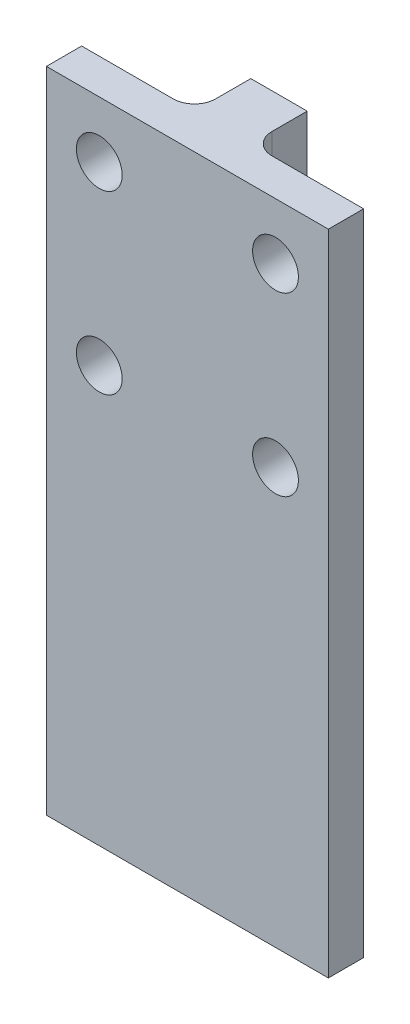
ISO-10303-21;
HEADER;
FILE_DESCRIPTION(('STEP AP214'),'2;1');
FILE_NAME('part.step','',(''),(''),'','','');
FILE_SCHEMA(('AUTOMOTIVE_DESIGN { 1 0 10303 214 1 1 1 1 }'));
ENDSEC;
DATA;
#1=APPLICATION_CONTEXT('core data for automotive mechanical design processes');
#2=APPLICATION_PROTOCOL_DEFINITION('international standard','automotive_design',2000,#1);
#3=PRODUCT_CONTEXT('',#1,'mechanical');
#4=PRODUCT('Part','Part','',(#3));
#5=PRODUCT_RELATED_PRODUCT_CATEGORY('part','',(#4));
#6=PRODUCT_DEFINITION_FORMATION('','',#4);
#7=PRODUCT_DEFINITION_CONTEXT('part definition',#1,'design');
#8=PRODUCT_DEFINITION('design','',#6,#7);
#9=PRODUCT_DEFINITION_SHAPE('','',#8);
#10=(LENGTH_UNIT() NAMED_UNIT(*) SI_UNIT(.MILLI.,.METRE.));
#11=(NAMED_UNIT(*) PLANE_ANGLE_UNIT() SI_UNIT($,.RADIAN.));
#12=(NAMED_UNIT(*) SI_UNIT($,.STERADIAN.) SOLID_ANGLE_UNIT());
#13=UNCERTAINTY_MEASURE_WITH_UNIT(LENGTH_MEASURE(1.E-05),#10,'distance_accuracy_value','');
#14=(GEOMETRIC_REPRESENTATION_CONTEXT(3) GLOBAL_UNCERTAINTY_ASSIGNED_CONTEXT((#13)) GLOBAL_UNIT_ASSIGNED_CONTEXT((#10,
#11,#12)) REPRESENTATION_CONTEXT('',''));
#15=CARTESIAN_POINT('',(0.,0.,0.));
#16=DIRECTION('',(0.,0.,1.));
#17=DIRECTION('',(1.,0.,0.));
#18=AXIS2_PLACEMENT_3D('',#15,#16,#17);
#19=CARTESIAN_POINT('',(-4.,-92.,-5.));
#20=DIRECTION('',(1.,0.,0.));
#21=DIRECTION('',(0.,0.,-1.));
#22=AXIS2_PLACEMENT_3D('',#19,#20,#21);
#23=PLANE('',#22);
#24=DIRECTION('',(0.,0.,-1.));
#25=VECTOR('',#24,1.);
#26=CARTESIAN_POINT('',(-4.,-92.,-5.));
#27=LINE('',#26,#25);
#28=CARTESIAN_POINT('',(-4.,-92.,-8.));
#29=VERTEX_POINT('',#28);
#30=CARTESIAN_POINT('',(-4.,-92.,-13.));
#31=VERTEX_POINT('',#30);
#32=EDGE_CURVE('E111',#29,#31,#27,.T.);
#33=ORIENTED_EDGE('',*,*,#32,.F.);
#34=DIRECTION('',(0.,1.,0.));
#35=VECTOR('',#34,1.);
#36=CARTESIAN_POINT('',(-4.,-92.,-8.));
#37=LINE('',#36,#35);
#38=CARTESIAN_POINT('',(-4.,0.,-8.));
#39=VERTEX_POINT('',#38);
#40=EDGE_CURVE('E145',#29,#39,#37,.T.);
#41=ORIENTED_EDGE('',*,*,#40,.T.);
#42=DIRECTION('',(0.,0.,-1.));
#43=VECTOR('',#42,1.);
#44=CARTESIAN_POINT('',(-4.,0.,-5.));
#45=LINE('',#44,#43);
#46=CARTESIAN_POINT('',(-4.,0.,-13.));
#47=VERTEX_POINT('',#46);
#48=EDGE_CURVE('E133',#39,#47,#45,.T.);
#49=ORIENTED_EDGE('',*,*,#48,.T.);
#50=DIRECTION('',(0.,1.,0.));
#51=VECTOR('',#50,1.);
#52=CARTESIAN_POINT('',(-4.,-92.,-13.));
#53=LINE('',#52,#51);
#54=EDGE_CURVE('E128',#31,#47,#53,.T.);
#55=ORIENTED_EDGE('',*,*,#54,.F.);
#56=EDGE_LOOP('',(#33,#41,#49,#55));
#57=FACE_BOUND('',#56,.T.);
#58=ADVANCED_FACE('F34',(#57),#23,.F.);
#59=CARTESIAN_POINT('',(-4.,-92.,-13.));
#60=DIRECTION('',(0.,0.,1.));
#61=DIRECTION('',(1.,0.,0.));
#62=AXIS2_PLACEMENT_3D('',#59,#60,#61);
#63=PLANE('',#62);
#64=DIRECTION('',(1.,0.,0.));
#65=VECTOR('',#64,1.);
#66=CARTESIAN_POINT('',(-4.,0.,-13.));
#67=LINE('',#66,#65);
#68=CARTESIAN_POINT('',(4.,0.,-13.));
#69=VERTEX_POINT('',#68);
#70=EDGE_CURVE('E192',#47,#69,#67,.T.);
#71=ORIENTED_EDGE('',*,*,#70,.T.);
#72=DIRECTION('',(0.,1.,0.));
#73=VECTOR('',#72,1.);
#74=CARTESIAN_POINT('',(4.,-92.,-13.));
#75=LINE('',#74,#73);
#76=CARTESIAN_POINT('',(4.,-92.,-13.));
#77=VERTEX_POINT('',#76);
#78=EDGE_CURVE('E130',#77,#69,#75,.T.);
#79=ORIENTED_EDGE('',*,*,#78,.F.);
#80=DIRECTION('',(1.,0.,0.));
#81=VECTOR('',#80,1.);
#82=CARTESIAN_POINT('',(-4.,-92.,-13.));
#83=LINE('',#82,#81);
#84=EDGE_CURVE('E115',#31,#77,#83,.T.);
#85=ORIENTED_EDGE('',*,*,#84,.F.);
#86=ORIENTED_EDGE('',*,*,#54,.T.);
#87=EDGE_LOOP('',(#71,#79,#85,#86));
#88=FACE_BOUND('',#87,.T.);
#89=ADVANCED_FACE('F127',(#88),#63,.F.);
#90=CARTESIAN_POINT('',(4.,-92.,-5.));
#91=DIRECTION('',(1.,0.,0.));
#92=DIRECTION('',(0.,0.,-1.));
#93=AXIS2_PLACEMENT_3D('',#90,#91,#92);
#94=PLANE('',#93);
#95=DIRECTION('',(0.,0.,-1.));
#96=VECTOR('',#95,1.);
#97=CARTESIAN_POINT('',(4.,0.,-5.));
#98=LINE('',#97,#96);
#99=CARTESIAN_POINT('',(4.,0.,-8.));
#100=VERTEX_POINT('',#99);
#101=EDGE_CURVE('E194',#100,#69,#98,.T.);
#102=ORIENTED_EDGE('',*,*,#101,.F.);
#103=DIRECTION('',(0.,1.,0.));
#104=VECTOR('',#103,1.);
#105=CARTESIAN_POINT('',(4.,-92.,-8.));
#106=LINE('',#105,#104);
#107=CARTESIAN_POINT('',(4.,-92.,-8.));
#108=VERTEX_POINT('',#107);
#109=EDGE_CURVE('E138',#100,#108,#106,.F.);
#110=ORIENTED_EDGE('',*,*,#109,.T.);
#111=DIRECTION('',(0.,0.,-1.));
#112=VECTOR('',#111,1.);
#113=CARTESIAN_POINT('',(4.,-92.,-5.));
#114=LINE('',#113,#112);
#115=EDGE_CURVE('E131',#108,#77,#114,.T.);
#116=ORIENTED_EDGE('',*,*,#115,.T.);
#117=ORIENTED_EDGE('',*,*,#78,.T.);
#118=EDGE_LOOP('',(#102,#110,#116,#117));
#119=FACE_BOUND('',#118,.T.);
#120=ADVANCED_FACE('F237',(#119),#94,.T.);
#121=CARTESIAN_POINT('',(4.,-92.,-5.));
#122=DIRECTION('',(0.,0.,1.));
#123=DIRECTION('',(1.,0.,0.));
#124=AXIS2_PLACEMENT_3D('',#121,#122,#123);
#125=PLANE('',#124);
#126=CARTESIAN_POINT('',(12.5,-33.,-5.));
#127=DIRECTION('',(0.,0.,1.));
#128=DIRECTION('',(1.,0.,0.));
#129=AXIS2_PLACEMENT_3D('',#126,#127,#128);
#130=CIRCLE('',#129,3.25);
#131=CARTESIAN_POINT('',(15.75,-33.,-5.));
#132=VERTEX_POINT('',#131);
#133=EDGE_CURVE('E173',#132,#132,#130,.T.);
#134=ORIENTED_EDGE('',*,*,#133,.T.);
#135=EDGE_LOOP('',(#134));
#136=FACE_BOUND('',#135,.T.);
#137=CARTESIAN_POINT('',(12.5,-8.,-5.));
#138=DIRECTION('',(0.,0.,1.));
#139=DIRECTION('',(1.,0.,0.));
#140=AXIS2_PLACEMENT_3D('',#137,#138,#139);
#141=CIRCLE('',#140,3.25);
#142=CARTESIAN_POINT('',(15.75,-8.,-5.));
#143=VERTEX_POINT('',#142);
#144=EDGE_CURVE('E158',#143,#143,#141,.T.);
#145=ORIENTED_EDGE('',*,*,#144,.T.);
#146=EDGE_LOOP('',(#145));
#147=FACE_BOUND('',#146,.T.);
#148=DIRECTION('',(1.,0.,0.));
#149=VECTOR('',#148,1.);
#150=CARTESIAN_POINT('',(4.,-92.,-5.));
#151=LINE('',#150,#149);
#152=CARTESIAN_POINT('',(7.,-92.,-5.));
#153=VERTEX_POINT('',#152);
#154=CARTESIAN_POINT('',(20.,-92.,-5.));
#155=VERTEX_POINT('',#154);
#156=EDGE_CURVE('E177',#153,#155,#151,.T.);
#157=ORIENTED_EDGE('',*,*,#156,.F.);
#158=DIRECTION('',(0.,1.,0.));
#159=VECTOR('',#158,1.);
#160=CARTESIAN_POINT('',(7.,-92.,-5.));
#161=LINE('',#160,#159);
#162=CARTESIAN_POINT('',(7.,0.,-5.));
#163=VERTEX_POINT('',#162);
#164=EDGE_CURVE('E135',#153,#163,#161,.T.);
#165=ORIENTED_EDGE('',*,*,#164,.T.);
#166=DIRECTION('',(1.,0.,0.));
#167=VECTOR('',#166,1.);
#168=CARTESIAN_POINT('',(4.,0.,-5.));
#169=LINE('',#168,#167);
#170=CARTESIAN_POINT('',(20.,0.,-5.));
#171=VERTEX_POINT('',#170);
#172=EDGE_CURVE('E196',#163,#171,#169,.T.);
#173=ORIENTED_EDGE('',*,*,#172,.T.);
#174=DIRECTION('',(0.,1.,0.));
#175=VECTOR('',#174,1.);
#176=CARTESIAN_POINT('',(20.,-92.,-5.));
#177=LINE('',#176,#175);
#178=EDGE_CURVE('E140',#155,#171,#177,.T.);
#179=ORIENTED_EDGE('',*,*,#178,.F.);
#180=EDGE_LOOP('',(#157,#165,#173,#179));
#181=FACE_BOUND('',#180,.T.);
#182=ADVANCED_FACE('F231',(#136,#147,#181),#125,.F.);
#183=CARTESIAN_POINT('',(20.,-92.,0.));
#184=DIRECTION('',(1.,0.,0.));
#185=DIRECTION('',(0.,0.,-1.));
#186=AXIS2_PLACEMENT_3D('',#183,#184,#185);
#187=PLANE('',#186);
#188=DIRECTION('',(0.,0.,-1.));
#189=VECTOR('',#188,1.);
#190=CARTESIAN_POINT('',(20.,0.,0.));
#191=LINE('',#190,#189);
#192=CARTESIAN_POINT('',(20.,0.,0.));
#193=VERTEX_POINT('',#192);
#194=EDGE_CURVE('E198',#193,#171,#191,.T.);
#195=ORIENTED_EDGE('',*,*,#194,.F.);
#196=DIRECTION('',(0.,1.,0.));
#197=VECTOR('',#196,1.);
#198=CARTESIAN_POINT('',(20.,-92.,0.));
#199=LINE('',#198,#197);
#200=CARTESIAN_POINT('',(20.,-92.,0.));
#201=VERTEX_POINT('',#200);
#202=EDGE_CURVE('E212',#201,#193,#199,.T.);
#203=ORIENTED_EDGE('',*,*,#202,.F.);
#204=DIRECTION('',(0.,0.,-1.));
#205=VECTOR('',#204,1.);
#206=CARTESIAN_POINT('',(20.,-92.,0.));
#207=LINE('',#206,#205);
#208=EDGE_CURVE('E179',#201,#155,#207,.T.);
#209=ORIENTED_EDGE('',*,*,#208,.T.);
#210=ORIENTED_EDGE('',*,*,#178,.T.);
#211=EDGE_LOOP('',(#195,#203,#209,#210));
#212=FACE_BOUND('',#211,.T.);
#213=ADVANCED_FACE('F217',(#212),#187,.T.);
#214=CARTESIAN_POINT('',(-20.,-92.,0.));
#215=DIRECTION('',(0.,0.,1.));
#216=DIRECTION('',(1.,0.,0.));
#217=AXIS2_PLACEMENT_3D('',#214,#215,#216);
#218=PLANE('',#217);
#219=CARTESIAN_POINT('',(-12.5,-8.,0.));
#220=DIRECTION('',(0.,0.,1.));
#221=DIRECTION('',(-1.,0.,0.));
#222=AXIS2_PLACEMENT_3D('',#219,#220,#221);
#223=CIRCLE('',#222,3.25);
#224=CARTESIAN_POINT('',(-15.75,-8.,0.));
#225=VERTEX_POINT('',#224);
#226=EDGE_CURVE('E169',#225,#225,#223,.T.);
#227=ORIENTED_EDGE('',*,*,#226,.F.);
#228=EDGE_LOOP('',(#227));
#229=FACE_BOUND('',#228,.T.);
#230=CARTESIAN_POINT('',(-12.5,-33.,0.));
#231=DIRECTION('',(0.,0.,1.));
#232=DIRECTION('',(-1.,0.,0.));
#233=AXIS2_PLACEMENT_3D('',#230,#231,#232);
#234=CIRCLE('',#233,3.25);
#235=CARTESIAN_POINT('',(-15.75,-33.,0.));
#236=VERTEX_POINT('',#235);
#237=EDGE_CURVE('E165',#236,#236,#234,.T.);
#238=ORIENTED_EDGE('',*,*,#237,.F.);
#239=EDGE_LOOP('',(#238));
#240=FACE_BOUND('',#239,.T.);
#241=CARTESIAN_POINT('',(12.5,-33.,0.));
#242=DIRECTION('',(0.,0.,1.));
#243=DIRECTION('',(1.,0.,0.));
#244=AXIS2_PLACEMENT_3D('',#241,#242,#243);
#245=CIRCLE('',#244,3.25);
#246=CARTESIAN_POINT('',(15.75,-33.,0.));
#247=VERTEX_POINT('',#246);
#248=EDGE_CURVE('E160',#247,#247,#245,.T.);
#249=ORIENTED_EDGE('',*,*,#248,.F.);
#250=EDGE_LOOP('',(#249));
#251=FACE_BOUND('',#250,.T.);
#252=CARTESIAN_POINT('',(12.5,-8.,0.));
#253=DIRECTION('',(0.,0.,1.));
#254=DIRECTION('',(1.,0.,0.));
#255=AXIS2_PLACEMENT_3D('',#252,#253,#254);
#256=CIRCLE('',#255,3.25);
#257=CARTESIAN_POINT('',(15.75,-8.,0.));
#258=VERTEX_POINT('',#257);
#259=EDGE_CURVE('E154',#258,#258,#256,.T.);
#260=ORIENTED_EDGE('',*,*,#259,.F.);
#261=EDGE_LOOP('',(#260));
#262=FACE_BOUND('',#261,.T.);
#263=DIRECTION('',(1.,0.,0.));
#264=VECTOR('',#263,1.);
#265=CARTESIAN_POINT('',(-20.,0.,0.));
#266=LINE('',#265,#264);
#267=CARTESIAN_POINT('',(-20.,0.,0.));
#268=VERTEX_POINT('',#267);
#269=EDGE_CURVE('E201',#268,#193,#266,.T.);
#270=ORIENTED_EDGE('',*,*,#269,.F.);
#271=DIRECTION('',(0.,1.,0.));
#272=VECTOR('',#271,1.);
#273=CARTESIAN_POINT('',(-20.,-92.,0.));
#274=LINE('',#273,#272);
#275=CARTESIAN_POINT('',(-20.,-92.,0.));
#276=VERTEX_POINT('',#275);
#277=EDGE_CURVE('E210',#276,#268,#274,.T.);
#278=ORIENTED_EDGE('',*,*,#277,.F.);
#279=DIRECTION('',(1.,0.,0.));
#280=VECTOR('',#279,1.);
#281=CARTESIAN_POINT('',(-20.,-92.,0.));
#282=LINE('',#281,#280);
#283=EDGE_CURVE('E182',#276,#201,#282,.T.);
#284=ORIENTED_EDGE('',*,*,#283,.T.);
#285=ORIENTED_EDGE('',*,*,#202,.T.);
#286=EDGE_LOOP('',(#270,#278,#284,#285));
#287=FACE_BOUND('',#286,.T.);
#288=ADVANCED_FACE('F226',(#229,#240,#251,#262,#287),#218,.T.);
#289=CARTESIAN_POINT('',(-20.,-92.,0.));
#290=DIRECTION('',(1.,0.,0.));
#291=DIRECTION('',(0.,0.,-1.));
#292=AXIS2_PLACEMENT_3D('',#289,#290,#291);
#293=PLANE('',#292);
#294=DIRECTION('',(0.,0.,-1.));
#295=VECTOR('',#294,1.);
#296=CARTESIAN_POINT('',(-20.,0.,0.));
#297=LINE('',#296,#295);
#298=CARTESIAN_POINT('',(-20.,0.,-5.));
#299=VERTEX_POINT('',#298);
#300=EDGE_CURVE('E204',#268,#299,#297,.T.);
#301=ORIENTED_EDGE('',*,*,#300,.T.);
#302=DIRECTION('',(0.,1.,0.));
#303=VECTOR('',#302,1.);
#304=CARTESIAN_POINT('',(-20.,-92.,-5.));
#305=LINE('',#304,#303);
#306=CARTESIAN_POINT('',(-20.,-92.,-5.));
#307=VERTEX_POINT('',#306);
#308=EDGE_CURVE('E190',#307,#299,#305,.T.);
#309=ORIENTED_EDGE('',*,*,#308,.F.);
#310=DIRECTION('',(0.,0.,-1.));
#311=VECTOR('',#310,1.);
#312=CARTESIAN_POINT('',(-20.,-92.,0.));
#313=LINE('',#312,#311);
#314=EDGE_CURVE('E185',#276,#307,#313,.T.);
#315=ORIENTED_EDGE('',*,*,#314,.F.);
#316=ORIENTED_EDGE('',*,*,#277,.T.);
#317=EDGE_LOOP('',(#301,#309,#315,#316));
#318=FACE_BOUND('',#317,.T.);
#319=ADVANCED_FACE('F268',(#318),#293,.F.);
#320=CARTESIAN_POINT('',(-4.,-92.,-5.));
#321=DIRECTION('',(0.,0.,-1.));
#322=DIRECTION('',(-1.,0.,0.));
#323=AXIS2_PLACEMENT_3D('',#320,#321,#322);
#324=PLANE('',#323);
#325=CARTESIAN_POINT('',(-12.5,-8.,-5.));
#326=DIRECTION('',(0.,0.,-1.));
#327=DIRECTION('',(-1.,0.,0.));
#328=AXIS2_PLACEMENT_3D('',#325,#326,#327);
#329=CIRCLE('',#328,3.25);
#330=CARTESIAN_POINT('',(-15.75,-8.,-5.));
#331=VERTEX_POINT('',#330);
#332=EDGE_CURVE('E38',#331,#331,#329,.T.);
#333=ORIENTED_EDGE('',*,*,#332,.F.);
#334=EDGE_LOOP('',(#333));
#335=FACE_BOUND('',#334,.T.);
#336=CARTESIAN_POINT('',(-12.5,-33.,-5.));
#337=DIRECTION('',(0.,0.,-1.));
#338=DIRECTION('',(-1.,0.,0.));
#339=AXIS2_PLACEMENT_3D('',#336,#337,#338);
#340=CIRCLE('',#339,3.25);
#341=CARTESIAN_POINT('',(-15.75,-33.,-5.));
#342=VERTEX_POINT('',#341);
#343=EDGE_CURVE('E152',#342,#342,#340,.T.);
#344=ORIENTED_EDGE('',*,*,#343,.F.);
#345=EDGE_LOOP('',(#344));
#346=FACE_BOUND('',#345,.T.);
#347=DIRECTION('',(-1.,0.,0.));
#348=VECTOR('',#347,1.);
#349=CARTESIAN_POINT('',(-4.,0.,-5.));
#350=LINE('',#349,#348);
#351=CARTESIAN_POINT('',(-7.,0.,-5.));
#352=VERTEX_POINT('',#351);
#353=EDGE_CURVE('E122',#352,#299,#350,.T.);
#354=ORIENTED_EDGE('',*,*,#353,.F.);
#355=DIRECTION('',(0.,1.,0.));
#356=VECTOR('',#355,1.);
#357=CARTESIAN_POINT('',(-7.,-92.,-5.));
#358=LINE('',#357,#356);
#359=CARTESIAN_POINT('',(-7.,-92.,-5.));
#360=VERTEX_POINT('',#359);
#361=EDGE_CURVE('E51',#352,#360,#358,.F.);
#362=ORIENTED_EDGE('',*,*,#361,.T.);
#363=DIRECTION('',(-1.,0.,0.));
#364=VECTOR('',#363,1.);
#365=CARTESIAN_POINT('',(-4.,-92.,-5.));
#366=LINE('',#365,#364);
#367=EDGE_CURVE('E188',#360,#307,#366,.T.);
#368=ORIENTED_EDGE('',*,*,#367,.T.);
#369=ORIENTED_EDGE('',*,*,#308,.T.);
#370=EDGE_LOOP('',(#354,#362,#368,#369));
#371=FACE_BOUND('',#370,.T.);
#372=ADVANCED_FACE('F262',(#335,#346,#371),#324,.T.);
#373=CARTESIAN_POINT('',(0.,-92.,0.));
#374=DIRECTION('',(0.,-1.,0.));
#375=DIRECTION('',(0.,0.,-1.));
#376=AXIS2_PLACEMENT_3D('',#373,#374,#375);
#377=PLANE('',#376);
#378=ORIENTED_EDGE('',*,*,#367,.F.);
#379=CARTESIAN_POINT('',(-7.,-92.,-8.));
#380=DIRECTION('',(0.,-1.,0.));
#381=DIRECTION('',(0.,0.,-1.));
#382=AXIS2_PLACEMENT_3D('',#379,#380,#381);
#383=CIRCLE('',#382,3.);
#384=EDGE_CURVE('E11',#360,#29,#383,.F.);
#385=ORIENTED_EDGE('',*,*,#384,.T.);
#386=ORIENTED_EDGE('',*,*,#32,.T.);
#387=ORIENTED_EDGE('',*,*,#84,.T.);
#388=ORIENTED_EDGE('',*,*,#115,.F.);
#389=CARTESIAN_POINT('',(7.,-92.,-8.));
#390=DIRECTION('',(0.,-1.,0.));
#391=DIRECTION('',(0.,0.,-1.));
#392=AXIS2_PLACEMENT_3D('',#389,#390,#391);
#393=CIRCLE('',#392,3.);
#394=EDGE_CURVE('E150',#108,#153,#393,.F.);
#395=ORIENTED_EDGE('',*,*,#394,.T.);
#396=ORIENTED_EDGE('',*,*,#156,.T.);
#397=ORIENTED_EDGE('',*,*,#208,.F.);
#398=ORIENTED_EDGE('',*,*,#283,.F.);
#399=ORIENTED_EDGE('',*,*,#314,.T.);
#400=EDGE_LOOP('',(#378,#385,#386,#387,#388,#395,#396,#397,#398,#399));
#401=FACE_BOUND('',#400,.T.);
#402=ADVANCED_FACE('F113',(#401),#377,.T.);
#403=CARTESIAN_POINT('',(0.,0.,0.));
#404=DIRECTION('',(0.,-1.,0.));
#405=DIRECTION('',(0.,0.,-1.));
#406=AXIS2_PLACEMENT_3D('',#403,#404,#405);
#407=PLANE('',#406);
#408=ORIENTED_EDGE('',*,*,#48,.F.);
#409=CARTESIAN_POINT('',(-7.,0.,-8.));
#410=DIRECTION('',(0.,-1.,0.));
#411=DIRECTION('',(0.,0.,-1.));
#412=AXIS2_PLACEMENT_3D('',#409,#410,#411);
#413=CIRCLE('',#412,3.);
#414=EDGE_CURVE('E43',#39,#352,#413,.T.);
#415=ORIENTED_EDGE('',*,*,#414,.T.);
#416=ORIENTED_EDGE('',*,*,#353,.T.);
#417=ORIENTED_EDGE('',*,*,#300,.F.);
#418=ORIENTED_EDGE('',*,*,#269,.T.);
#419=ORIENTED_EDGE('',*,*,#194,.T.);
#420=ORIENTED_EDGE('',*,*,#172,.F.);
#421=CARTESIAN_POINT('',(7.,0.,-8.));
#422=DIRECTION('',(0.,-1.,0.));
#423=DIRECTION('',(0.,0.,-1.));
#424=AXIS2_PLACEMENT_3D('',#421,#422,#423);
#425=CIRCLE('',#424,3.);
#426=EDGE_CURVE('E148',#163,#100,#425,.T.);
#427=ORIENTED_EDGE('',*,*,#426,.T.);
#428=ORIENTED_EDGE('',*,*,#101,.T.);
#429=ORIENTED_EDGE('',*,*,#70,.F.);
#430=EDGE_LOOP('',(#408,#415,#416,#417,#418,#419,#420,#427,#428,#429));
#431=FACE_BOUND('',#430,.T.);
#432=ADVANCED_FACE('F222',(#431),#407,.F.);
#433=CARTESIAN_POINT('',(7.,-92.,-8.));
#434=DIRECTION('',(0.,1.,0.));
#435=DIRECTION('',(0.,0.,1.));
#436=AXIS2_PLACEMENT_3D('',#433,#434,#435);
#437=CYLINDRICAL_SURFACE('',#436,3.);
#438=ORIENTED_EDGE('',*,*,#394,.F.);
#439=ORIENTED_EDGE('',*,*,#109,.F.);
#440=ORIENTED_EDGE('',*,*,#426,.F.);
#441=ORIENTED_EDGE('',*,*,#164,.F.);
#442=EDGE_LOOP('',(#438,#439,#440,#441));
#443=FACE_BOUND('',#442,.T.);
#444=ADVANCED_FACE('F233',(#443),#437,.F.);
#445=CARTESIAN_POINT('',(-7.,-92.,-8.));
#446=DIRECTION('',(0.,1.,0.));
#447=DIRECTION('',(0.,0.,1.));
#448=AXIS2_PLACEMENT_3D('',#445,#446,#447);
#449=CYLINDRICAL_SURFACE('',#448,3.);
#450=ORIENTED_EDGE('',*,*,#384,.F.);
#451=ORIENTED_EDGE('',*,*,#361,.F.);
#452=ORIENTED_EDGE('',*,*,#414,.F.);
#453=ORIENTED_EDGE('',*,*,#40,.F.);
#454=EDGE_LOOP('',(#450,#451,#452,#453));
#455=FACE_BOUND('',#454,.T.);
#456=ADVANCED_FACE('F36',(#455),#449,.F.);
#457=CARTESIAN_POINT('',(-12.5,-33.,-92.));
#458=DIRECTION('',(0.,0.,1.));
#459=DIRECTION('',(1.,0.,0.));
#460=AXIS2_PLACEMENT_3D('',#457,#458,#459);
#461=CYLINDRICAL_SURFACE('',#460,3.25);
#462=ORIENTED_EDGE('',*,*,#343,.T.);
#463=EDGE_LOOP('',(#462));
#464=FACE_BOUND('',#463,.T.);
#465=ORIENTED_EDGE('',*,*,#237,.T.);
#466=EDGE_LOOP('',(#465));
#467=FACE_BOUND('',#466,.T.);
#468=ADVANCED_FACE('F256',(#464,#467),#461,.F.);
#469=CARTESIAN_POINT('',(-12.5,-8.,-92.));
#470=DIRECTION('',(0.,0.,1.));
#471=DIRECTION('',(1.,0.,0.));
#472=AXIS2_PLACEMENT_3D('',#469,#470,#471);
#473=CYLINDRICAL_SURFACE('',#472,3.25);
#474=ORIENTED_EDGE('',*,*,#332,.T.);
#475=EDGE_LOOP('',(#474));
#476=FACE_BOUND('',#475,.T.);
#477=ORIENTED_EDGE('',*,*,#226,.T.);
#478=EDGE_LOOP('',(#477));
#479=FACE_BOUND('',#478,.T.);
#480=ADVANCED_FACE('F346',(#476,#479),#473,.F.);
#481=CARTESIAN_POINT('',(12.5,-8.,-92.));
#482=DIRECTION('',(0.,0.,1.));
#483=DIRECTION('',(1.,0.,0.));
#484=AXIS2_PLACEMENT_3D('',#481,#482,#483);
#485=CYLINDRICAL_SURFACE('',#484,3.25);
#486=ORIENTED_EDGE('',*,*,#259,.T.);
#487=EDGE_LOOP('',(#486));
#488=FACE_BOUND('',#487,.T.);
#489=ORIENTED_EDGE('',*,*,#144,.F.);
#490=EDGE_LOOP('',(#489));
#491=FACE_BOUND('',#490,.T.);
#492=ADVANCED_FACE('F352',(#488,#491),#485,.F.);
#493=CARTESIAN_POINT('',(12.5,-33.,-92.));
#494=DIRECTION('',(0.,0.,1.));
#495=DIRECTION('',(1.,0.,0.));
#496=AXIS2_PLACEMENT_3D('',#493,#494,#495);
#497=CYLINDRICAL_SURFACE('',#496,3.25);
#498=ORIENTED_EDGE('',*,*,#248,.T.);
#499=EDGE_LOOP('',(#498));
#500=FACE_BOUND('',#499,.T.);
#501=ORIENTED_EDGE('',*,*,#133,.F.);
#502=EDGE_LOOP('',(#501));
#503=FACE_BOUND('',#502,.T.);
#504=ADVANCED_FACE('F360',(#500,#503),#497,.F.);
#505=CLOSED_SHELL('',(#58,#89,#120,#182,#213,#288,#319,#372,#402,#432,#444,#456,#468,#480,#492,#504));
#506=MANIFOLD_SOLID_BREP('B2',#505);
#507=ADVANCED_BREP_SHAPE_REPRESENTATION('',(#18,#506),#14);
#508=SHAPE_DEFINITION_REPRESENTATION(#9,#507);
ENDSEC;
END-ISO-10303-21;
